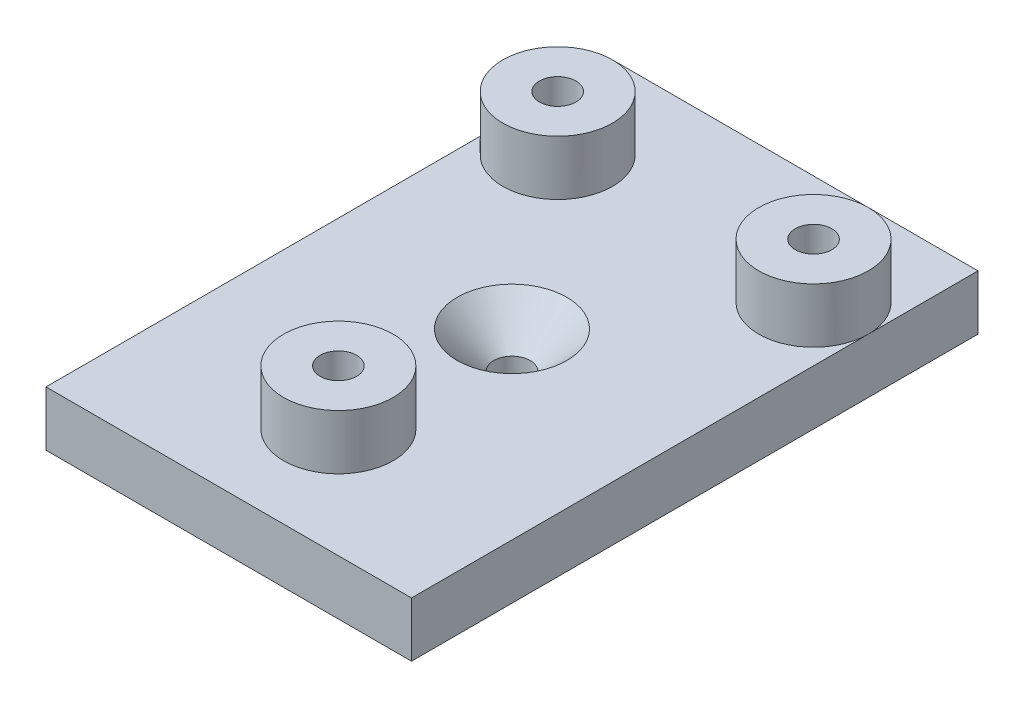
ISO-10303-21;
HEADER;
FILE_DESCRIPTION(('STEP AP214'),'2;1');
FILE_NAME('part.step','',(''),(''),'','','');
FILE_SCHEMA(('AUTOMOTIVE_DESIGN { 1 0 10303 214 1 1 1 1 }'));
ENDSEC;
DATA;
#1=APPLICATION_CONTEXT('core data for automotive mechanical design processes');
#2=APPLICATION_PROTOCOL_DEFINITION('international standard','automotive_design',2000,#1);
#3=PRODUCT_CONTEXT('',#1,'mechanical');
#4=PRODUCT('Part','Part','',(#3));
#5=PRODUCT_RELATED_PRODUCT_CATEGORY('part','',(#4));
#6=PRODUCT_DEFINITION_FORMATION('','',#4);
#7=PRODUCT_DEFINITION_CONTEXT('part definition',#1,'design');
#8=PRODUCT_DEFINITION('design','',#6,#7);
#9=PRODUCT_DEFINITION_SHAPE('','',#8);
#10=(LENGTH_UNIT() NAMED_UNIT(*) SI_UNIT(.MILLI.,.METRE.));
#11=(NAMED_UNIT(*) PLANE_ANGLE_UNIT() SI_UNIT($,.RADIAN.));
#12=(NAMED_UNIT(*) SI_UNIT($,.STERADIAN.) SOLID_ANGLE_UNIT());
#13=UNCERTAINTY_MEASURE_WITH_UNIT(LENGTH_MEASURE(1.E-05),#10,'distance_accuracy_value','');
#14=(GEOMETRIC_REPRESENTATION_CONTEXT(3) GLOBAL_UNCERTAINTY_ASSIGNED_CONTEXT((#13)) GLOBAL_UNIT_ASSIGNED_CONTEXT((#10,
#11,#12)) REPRESENTATION_CONTEXT('',''));
#15=CARTESIAN_POINT('',(0.,0.,0.));
#16=DIRECTION('',(0.,0.,1.));
#17=DIRECTION('',(1.,0.,0.));
#18=AXIS2_PLACEMENT_3D('',#15,#16,#17);
#19=CARTESIAN_POINT('',(-10.9436046511628,3.,-6.58255813953488));
#20=DIRECTION('',(1.,0.,0.));
#21=DIRECTION('',(0.,0.,-1.));
#22=AXIS2_PLACEMENT_3D('',#19,#20,#21);
#23=PLANE('',#22);
#24=DIRECTION('',(0.,0.,1.));
#25=VECTOR('',#24,1.);
#26=CARTESIAN_POINT('',(-10.9436046511628,0.,-6.58255813953488));
#27=LINE('',#26,#25);
#28=CARTESIAN_POINT('',(-10.9436046511628,0.,-6.58255813953488));
#29=VERTEX_POINT('',#28);
#30=CARTESIAN_POINT('',(-10.9436046511628,0.,24.4174418604651));
#31=VERTEX_POINT('',#30);
#32=EDGE_CURVE('E122',#29,#31,#27,.T.);
#33=ORIENTED_EDGE('',*,*,#32,.T.);
#34=DIRECTION('',(0.,-1.,0.));
#35=VECTOR('',#34,1.);
#36=CARTESIAN_POINT('',(-10.9436046511628,3.,24.4174418604651));
#37=LINE('',#36,#35);
#38=CARTESIAN_POINT('',(-10.9436046511628,3.,24.4174418604651));
#39=VERTEX_POINT('',#38);
#40=EDGE_CURVE('E110',#39,#31,#37,.T.);
#41=ORIENTED_EDGE('',*,*,#40,.F.);
#42=DIRECTION('',(0.,0.,1.));
#43=VECTOR('',#42,1.);
#44=CARTESIAN_POINT('',(-10.9436046511628,3.,-6.58255813953488));
#45=LINE('',#44,#43);
#46=CARTESIAN_POINT('',(-10.9436046511628,3.,-0.582558139534882));
#47=VERTEX_POINT('',#46);
#48=EDGE_CURVE('E95',#47,#39,#45,.T.);
#49=ORIENTED_EDGE('',*,*,#48,.F.);
#50=CARTESIAN_POINT('',(-10.9436046511628,3.,-6.58255813953488));
#51=VERTEX_POINT('',#50);
#52=EDGE_CURVE('E99',#51,#47,#45,.T.);
#53=ORIENTED_EDGE('',*,*,#52,.F.);
#54=DIRECTION('',(0.,-1.,0.));
#55=VECTOR('',#54,1.);
#56=CARTESIAN_POINT('',(-10.9436046511628,3.,-6.58255813953488));
#57=LINE('',#56,#55);
#58=EDGE_CURVE('E121',#51,#29,#57,.T.);
#59=ORIENTED_EDGE('',*,*,#58,.T.);
#60=EDGE_LOOP('',(#33,#41,#49,#53,#59));
#61=FACE_BOUND('',#60,.T.);
#62=ADVANCED_FACE('F45',(#61),#23,.F.);
#63=CARTESIAN_POINT('',(-10.9436046511628,3.,24.4174418604651));
#64=DIRECTION('',(0.,0.,-1.));
#65=DIRECTION('',(-1.,0.,0.));
#66=AXIS2_PLACEMENT_3D('',#63,#64,#65);
#67=PLANE('',#66);
#68=DIRECTION('',(1.,0.,0.));
#69=VECTOR('',#68,1.);
#70=CARTESIAN_POINT('',(-10.9436046511628,0.,24.4174418604651));
#71=LINE('',#70,#69);
#72=CARTESIAN_POINT('',(9.05639534883721,0.,24.4174418604651));
#73=VERTEX_POINT('',#72);
#74=EDGE_CURVE('E124',#31,#73,#71,.T.);
#75=ORIENTED_EDGE('',*,*,#74,.T.);
#76=DIRECTION('',(0.,-1.,0.));
#77=VECTOR('',#76,1.);
#78=CARTESIAN_POINT('',(9.05639534883721,3.,24.4174418604651));
#79=LINE('',#78,#77);
#80=CARTESIAN_POINT('',(9.05639534883721,3.,24.4174418604651));
#81=VERTEX_POINT('',#80);
#82=EDGE_CURVE('E131',#81,#73,#79,.T.);
#83=ORIENTED_EDGE('',*,*,#82,.F.);
#84=DIRECTION('',(1.,0.,0.));
#85=VECTOR('',#84,1.);
#86=CARTESIAN_POINT('',(-10.9436046511628,3.,24.4174418604651));
#87=LINE('',#86,#85);
#88=EDGE_CURVE('E105',#39,#81,#87,.T.);
#89=ORIENTED_EDGE('',*,*,#88,.F.);
#90=ORIENTED_EDGE('',*,*,#40,.T.);
#91=EDGE_LOOP('',(#75,#83,#89,#90));
#92=FACE_BOUND('',#91,.T.);
#93=ADVANCED_FACE('F155',(#92),#67,.F.);
#94=CARTESIAN_POINT('',(9.05639534883721,3.,-6.58255813953488));
#95=DIRECTION('',(-1.,0.,0.));
#96=DIRECTION('',(0.,0.,1.));
#97=AXIS2_PLACEMENT_3D('',#94,#95,#96);
#98=PLANE('',#97);
#99=DIRECTION('',(0.,0.,-1.));
#100=VECTOR('',#99,1.);
#101=CARTESIAN_POINT('',(9.05639534883721,0.,-6.58255813953488));
#102=LINE('',#101,#100);
#103=CARTESIAN_POINT('',(9.05639534883721,0.,-6.58255813953488));
#104=VERTEX_POINT('',#103);
#105=EDGE_CURVE('E111',#73,#104,#102,.T.);
#106=ORIENTED_EDGE('',*,*,#105,.T.);
#107=DIRECTION('',(0.,-1.,0.));
#108=VECTOR('',#107,1.);
#109=CARTESIAN_POINT('',(9.05639534883721,3.,-6.58255813953488));
#110=LINE('',#109,#108);
#111=CARTESIAN_POINT('',(9.05639534883721,3.,-6.58255813953488));
#112=VERTEX_POINT('',#111);
#113=EDGE_CURVE('E129',#112,#104,#110,.T.);
#114=ORIENTED_EDGE('',*,*,#113,.F.);
#115=DIRECTION('',(0.,0.,-1.));
#116=VECTOR('',#115,1.);
#117=CARTESIAN_POINT('',(9.05639534883721,3.,-6.58255813953488));
#118=LINE('',#117,#116);
#119=CARTESIAN_POINT('',(9.05639534883721,3.,-0.582558139534882));
#120=VERTEX_POINT('',#119);
#121=EDGE_CURVE('E117',#120,#112,#118,.T.);
#122=ORIENTED_EDGE('',*,*,#121,.F.);
#123=EDGE_CURVE('E118',#81,#120,#118,.T.);
#124=ORIENTED_EDGE('',*,*,#123,.F.);
#125=ORIENTED_EDGE('',*,*,#82,.T.);
#126=EDGE_LOOP('',(#106,#114,#122,#124,#125));
#127=FACE_BOUND('',#126,.T.);
#128=ADVANCED_FACE('F161',(#127),#98,.F.);
#129=CARTESIAN_POINT('',(-10.9436046511628,3.,-6.58255813953488));
#130=DIRECTION('',(0.,0.,1.));
#131=DIRECTION('',(1.,0.,0.));
#132=AXIS2_PLACEMENT_3D('',#129,#130,#131);
#133=PLANE('',#132);
#134=DIRECTION('',(-1.,0.,0.));
#135=VECTOR('',#134,1.);
#136=CARTESIAN_POINT('',(-10.9436046511628,0.,-6.58255813953488));
#137=LINE('',#136,#135);
#138=EDGE_CURVE('E88',#104,#29,#137,.T.);
#139=ORIENTED_EDGE('',*,*,#138,.T.);
#140=ORIENTED_EDGE('',*,*,#58,.F.);
#141=DIRECTION('',(-1.,0.,0.));
#142=VECTOR('',#141,1.);
#143=CARTESIAN_POINT('',(-10.9436046511628,3.,-6.58255813953488));
#144=LINE('',#143,#142);
#145=EDGE_CURVE('E67',#112,#51,#144,.T.);
#146=ORIENTED_EDGE('',*,*,#145,.F.);
#147=ORIENTED_EDGE('',*,*,#113,.T.);
#148=EDGE_LOOP('',(#139,#140,#146,#147));
#149=FACE_BOUND('',#148,.T.);
#150=ADVANCED_FACE('F166',(#149),#133,.F.);
#151=CARTESIAN_POINT('',(0.,3.,0.));
#152=DIRECTION('',(0.,1.,0.));
#153=DIRECTION('',(0.,0.,1.));
#154=AXIS2_PLACEMENT_3D('',#151,#152,#153);
#155=PLANE('',#154);
#156=CARTESIAN_POINT('',(-0.943604651162789,3.,8.91744186046512));
#157=DIRECTION('',(0.,1.,0.));
#158=DIRECTION('',(0.,0.,1.));
#159=AXIS2_PLACEMENT_3D('',#156,#157,#158);
#160=CIRCLE('',#159,3.00000000000001);
#161=CARTESIAN_POINT('',(-0.943604651162789,3.,11.9174418604651));
#162=VERTEX_POINT('',#161);
#163=EDGE_CURVE('E11',#162,#162,#160,.F.);
#164=ORIENTED_EDGE('',*,*,#163,.T.);
#165=EDGE_LOOP('',(#164));
#166=FACE_BOUND('',#165,.T.);
#167=CARTESIAN_POINT('',(-0.943604651162788,3.,18.4174418604651));
#168=DIRECTION('',(0.,1.,0.));
#169=DIRECTION('',(0.,0.,1.));
#170=AXIS2_PLACEMENT_3D('',#167,#168,#169);
#171=CIRCLE('',#170,3.);
#172=CARTESIAN_POINT('',(-0.943604651162788,3.,21.4174418604651));
#173=VERTEX_POINT('',#172);
#174=EDGE_CURVE('E221',#173,#173,#171,.T.);
#175=ORIENTED_EDGE('',*,*,#174,.F.);
#176=EDGE_LOOP('',(#175));
#177=FACE_BOUND('',#176,.T.);
#178=ORIENTED_EDGE('',*,*,#123,.T.);
#179=CARTESIAN_POINT('',(6.05639534883721,3.,-0.582558139534882));
#180=DIRECTION('',(0.,1.,0.));
#181=DIRECTION('',(0.,0.,-1.));
#182=AXIS2_PLACEMENT_3D('',#179,#180,#181);
#183=CIRCLE('',#182,3.);
#184=EDGE_CURVE('E59',#120,#120,#183,.T.);
#185=ORIENTED_EDGE('',*,*,#184,.F.);
#186=ORIENTED_EDGE('',*,*,#121,.T.);
#187=ORIENTED_EDGE('',*,*,#145,.T.);
#188=ORIENTED_EDGE('',*,*,#52,.T.);
#189=CARTESIAN_POINT('',(-7.94360465116279,3.,-0.582558139534882));
#190=DIRECTION('',(0.,1.,0.));
#191=DIRECTION('',(0.,0.,1.));
#192=AXIS2_PLACEMENT_3D('',#189,#190,#191);
#193=CIRCLE('',#192,3.);
#194=EDGE_CURVE('E103',#47,#47,#193,.T.);
#195=ORIENTED_EDGE('',*,*,#194,.F.);
#196=ORIENTED_EDGE('',*,*,#48,.T.);
#197=ORIENTED_EDGE('',*,*,#88,.T.);
#198=EDGE_LOOP('',(#178,#185,#186,#187,#188,#195,#196,#197));
#199=FACE_BOUND('',#198,.T.);
#200=ADVANCED_FACE('F101',(#166,#177,#199),#155,.T.);
#201=CARTESIAN_POINT('',(0.,0.,0.));
#202=DIRECTION('',(0.,1.,0.));
#203=DIRECTION('',(0.,0.,1.));
#204=AXIS2_PLACEMENT_3D('',#201,#202,#203);
#205=PLANE('',#204);
#206=CARTESIAN_POINT('',(-0.943604651162789,0.,8.91744186046512));
#207=DIRECTION('',(0.,1.,0.));
#208=DIRECTION('',(0.,0.,1.));
#209=AXIS2_PLACEMENT_3D('',#206,#207,#208);
#210=CIRCLE('',#209,1.);
#211=CARTESIAN_POINT('',(-0.943604651162789,0.,9.91744186046512));
#212=VERTEX_POINT('',#211);
#213=EDGE_CURVE('E228',#212,#212,#210,.T.);
#214=ORIENTED_EDGE('',*,*,#213,.T.);
#215=EDGE_LOOP('',(#214));
#216=FACE_BOUND('',#215,.T.);
#217=ORIENTED_EDGE('',*,*,#32,.F.);
#218=ORIENTED_EDGE('',*,*,#138,.F.);
#219=ORIENTED_EDGE('',*,*,#105,.F.);
#220=ORIENTED_EDGE('',*,*,#74,.F.);
#221=EDGE_LOOP('',(#217,#218,#219,#220));
#222=FACE_BOUND('',#221,.T.);
#223=ADVANCED_FACE('F169',(#216,#222),#205,.F.);
#224=CARTESIAN_POINT('',(-7.94360465116279,6.,-0.582558139534882));
#225=DIRECTION('',(0.,1.,0.));
#226=DIRECTION('',(0.,0.,1.));
#227=AXIS2_PLACEMENT_3D('',#224,#225,#226);
#228=PLANE('',#227);
#229=CARTESIAN_POINT('',(-7.94360465116279,6.,-0.582558139534882));
#230=DIRECTION('',(0.,1.,0.));
#231=DIRECTION('',(0.,0.,1.));
#232=AXIS2_PLACEMENT_3D('',#229,#230,#231);
#233=CIRCLE('',#232,3.);
#234=CARTESIAN_POINT('',(-7.94360465116279,6.,2.41744186046512));
#235=VERTEX_POINT('',#234);
#236=EDGE_CURVE('E125',#235,#235,#233,.T.);
#237=ORIENTED_EDGE('',*,*,#236,.T.);
#238=EDGE_LOOP('',(#237));
#239=FACE_BOUND('',#238,.T.);
#240=CARTESIAN_POINT('',(-7.94360465116279,6.,-0.582558139534882));
#241=DIRECTION('',(0.,1.,0.));
#242=DIRECTION('',(0.,0.,1.));
#243=AXIS2_PLACEMENT_3D('',#240,#241,#242);
#244=CIRCLE('',#243,1.);
#245=CARTESIAN_POINT('',(-7.94360465116279,6.,0.417441860465118));
#246=VERTEX_POINT('',#245);
#247=EDGE_CURVE('E239',#246,#246,#244,.T.);
#248=ORIENTED_EDGE('',*,*,#247,.F.);
#249=EDGE_LOOP('',(#248));
#250=FACE_BOUND('',#249,.T.);
#251=ADVANCED_FACE('F172',(#239,#250),#228,.T.);
#252=CARTESIAN_POINT('',(-7.94360465116279,6.,-0.582558139534882));
#253=DIRECTION('',(0.,-1.,0.));
#254=DIRECTION('',(0.,0.,-1.));
#255=AXIS2_PLACEMENT_3D('',#252,#253,#254);
#256=CYLINDRICAL_SURFACE('',#255,3.);
#257=ORIENTED_EDGE('',*,*,#236,.F.);
#258=EDGE_LOOP('',(#257));
#259=FACE_BOUND('',#258,.T.);
#260=ORIENTED_EDGE('',*,*,#194,.T.);
#261=EDGE_LOOP('',(#260));
#262=FACE_BOUND('',#261,.T.);
#263=ADVANCED_FACE('F178',(#259,#262),#256,.T.);
#264=CARTESIAN_POINT('',(-7.94360465116279,6.,-0.582558139534882));
#265=DIRECTION('',(0.,-1.,0.));
#266=DIRECTION('',(0.,0.,-1.));
#267=AXIS2_PLACEMENT_3D('',#264,#265,#266);
#268=CYLINDRICAL_SURFACE('',#267,1.);
#269=ORIENTED_EDGE('',*,*,#247,.T.);
#270=EDGE_LOOP('',(#269));
#271=FACE_BOUND('',#270,.T.);
#272=CARTESIAN_POINT('',(-7.94360465116279,3.,-0.582558139534882));
#273=DIRECTION('',(0.,1.,0.));
#274=DIRECTION('',(0.,0.,1.));
#275=AXIS2_PLACEMENT_3D('',#272,#273,#274);
#276=CIRCLE('',#275,1.);
#277=CARTESIAN_POINT('',(-7.94360465116279,3.,0.417441860465118));
#278=VERTEX_POINT('',#277);
#279=EDGE_CURVE('E238',#278,#278,#276,.T.);
#280=ORIENTED_EDGE('',*,*,#279,.F.);
#281=EDGE_LOOP('',(#280));
#282=FACE_BOUND('',#281,.T.);
#283=ADVANCED_FACE('F181',(#271,#282),#268,.F.);
#284=ORIENTED_EDGE('',*,*,#279,.T.);
#285=EDGE_LOOP('',(#284));
#286=FACE_BOUND('',#285,.T.);
#287=ADVANCED_FACE('F177',(#286),#155,.T.);
#288=CARTESIAN_POINT('',(6.05639534883721,6.,-0.582558139534882));
#289=DIRECTION('',(0.,-1.,0.));
#290=DIRECTION('',(0.,0.,-1.));
#291=AXIS2_PLACEMENT_3D('',#288,#289,#290);
#292=PLANE('',#291);
#293=CARTESIAN_POINT('',(6.05639534883721,6.,-0.582558139534882));
#294=DIRECTION('',(0.,1.,0.));
#295=DIRECTION('',(0.,0.,-1.));
#296=AXIS2_PLACEMENT_3D('',#293,#294,#295);
#297=CIRCLE('',#296,3.);
#298=CARTESIAN_POINT('',(6.05639534883721,6.,-3.58255813953488));
#299=VERTEX_POINT('',#298);
#300=EDGE_CURVE('E226',#299,#299,#297,.T.);
#301=ORIENTED_EDGE('',*,*,#300,.T.);
#302=EDGE_LOOP('',(#301));
#303=FACE_BOUND('',#302,.T.);
#304=CARTESIAN_POINT('',(6.05639534883721,6.,-0.582558139534882));
#305=DIRECTION('',(0.,1.,0.));
#306=DIRECTION('',(0.,0.,-1.));
#307=AXIS2_PLACEMENT_3D('',#304,#305,#306);
#308=CIRCLE('',#307,1.);
#309=CARTESIAN_POINT('',(6.05639534883721,6.,-1.58255813953488));
#310=VERTEX_POINT('',#309);
#311=EDGE_CURVE('E233',#310,#310,#308,.T.);
#312=ORIENTED_EDGE('',*,*,#311,.F.);
#313=EDGE_LOOP('',(#312));
#314=FACE_BOUND('',#313,.T.);
#315=ADVANCED_FACE('F195',(#303,#314),#292,.F.);
#316=CARTESIAN_POINT('',(6.05639534883721,6.,-0.582558139534882));
#317=DIRECTION('',(0.,-1.,0.));
#318=DIRECTION('',(0.,0.,-1.));
#319=AXIS2_PLACEMENT_3D('',#316,#317,#318);
#320=CYLINDRICAL_SURFACE('',#319,3.);
#321=ORIENTED_EDGE('',*,*,#300,.F.);
#322=EDGE_LOOP('',(#321));
#323=FACE_BOUND('',#322,.T.);
#324=ORIENTED_EDGE('',*,*,#184,.T.);
#325=EDGE_LOOP('',(#324));
#326=FACE_BOUND('',#325,.T.);
#327=ADVANCED_FACE('F193',(#323,#326),#320,.T.);
#328=CARTESIAN_POINT('',(6.05639534883721,6.,-0.582558139534882));
#329=DIRECTION('',(0.,-1.,0.));
#330=DIRECTION('',(0.,0.,-1.));
#331=AXIS2_PLACEMENT_3D('',#328,#329,#330);
#332=CYLINDRICAL_SURFACE('',#331,1.);
#333=ORIENTED_EDGE('',*,*,#311,.T.);
#334=EDGE_LOOP('',(#333));
#335=FACE_BOUND('',#334,.T.);
#336=CARTESIAN_POINT('',(6.05639534883721,3.,-0.582558139534882));
#337=DIRECTION('',(0.,1.,0.));
#338=DIRECTION('',(0.,0.,1.));
#339=AXIS2_PLACEMENT_3D('',#336,#337,#338);
#340=CIRCLE('',#339,1.);
#341=CARTESIAN_POINT('',(6.05639534883721,3.,0.417441860465118));
#342=VERTEX_POINT('',#341);
#343=EDGE_CURVE('E135',#342,#342,#340,.F.);
#344=ORIENTED_EDGE('',*,*,#343,.T.);
#345=EDGE_LOOP('',(#344));
#346=FACE_BOUND('',#345,.T.);
#347=ADVANCED_FACE('F189',(#335,#346),#332,.F.);
#348=ORIENTED_EDGE('',*,*,#343,.F.);
#349=EDGE_LOOP('',(#348));
#350=FACE_BOUND('',#349,.T.);
#351=ADVANCED_FACE('F192',(#350),#155,.T.);
#352=CARTESIAN_POINT('',(-0.943604651162788,6.,18.4174418604651));
#353=DIRECTION('',(0.,1.,0.));
#354=DIRECTION('',(0.,0.,1.));
#355=AXIS2_PLACEMENT_3D('',#352,#353,#354);
#356=PLANE('',#355);
#357=CARTESIAN_POINT('',(-0.943604651162788,6.,18.4174418604651));
#358=DIRECTION('',(0.,1.,0.));
#359=DIRECTION('',(0.,0.,1.));
#360=AXIS2_PLACEMENT_3D('',#357,#358,#359);
#361=CIRCLE('',#360,3.);
#362=CARTESIAN_POINT('',(-0.943604651162788,6.,21.4174418604651));
#363=VERTEX_POINT('',#362);
#364=EDGE_CURVE('E218',#363,#363,#361,.T.);
#365=ORIENTED_EDGE('',*,*,#364,.T.);
#366=EDGE_LOOP('',(#365));
#367=FACE_BOUND('',#366,.T.);
#368=CARTESIAN_POINT('',(-0.943604651162788,6.,18.4174418604651));
#369=DIRECTION('',(0.,1.,0.));
#370=DIRECTION('',(0.,0.,1.));
#371=AXIS2_PLACEMENT_3D('',#368,#369,#370);
#372=CIRCLE('',#371,0.999999999999999);
#373=CARTESIAN_POINT('',(-0.943604651162788,6.,19.4174418604651));
#374=VERTEX_POINT('',#373);
#375=EDGE_CURVE('E223',#374,#374,#372,.T.);
#376=ORIENTED_EDGE('',*,*,#375,.F.);
#377=EDGE_LOOP('',(#376));
#378=FACE_BOUND('',#377,.T.);
#379=ADVANCED_FACE('F207',(#367,#378),#356,.T.);
#380=CARTESIAN_POINT('',(-0.943604651162788,6.,18.4174418604651));
#381=DIRECTION('',(0.,-1.,0.));
#382=DIRECTION('',(0.,0.,-1.));
#383=AXIS2_PLACEMENT_3D('',#380,#381,#382);
#384=CYLINDRICAL_SURFACE('',#383,3.);
#385=ORIENTED_EDGE('',*,*,#364,.F.);
#386=EDGE_LOOP('',(#385));
#387=FACE_BOUND('',#386,.T.);
#388=ORIENTED_EDGE('',*,*,#174,.T.);
#389=EDGE_LOOP('',(#388));
#390=FACE_BOUND('',#389,.T.);
#391=ADVANCED_FACE('F205',(#387,#390),#384,.T.);
#392=CARTESIAN_POINT('',(-0.943604651162788,6.,18.4174418604651));
#393=DIRECTION('',(0.,-1.,0.));
#394=DIRECTION('',(0.,0.,-1.));
#395=AXIS2_PLACEMENT_3D('',#392,#393,#394);
#396=CYLINDRICAL_SURFACE('',#395,0.999999999999999);
#397=ORIENTED_EDGE('',*,*,#375,.T.);
#398=EDGE_LOOP('',(#397));
#399=FACE_BOUND('',#398,.T.);
#400=CARTESIAN_POINT('',(-0.943604651162788,3.,18.4174418604651));
#401=DIRECTION('',(0.,1.,0.));
#402=DIRECTION('',(0.,0.,1.));
#403=AXIS2_PLACEMENT_3D('',#400,#401,#402);
#404=CIRCLE('',#403,0.999999999999999);
#405=CARTESIAN_POINT('',(-0.943604651162788,3.,19.4174418604651));
#406=VERTEX_POINT('',#405);
#407=EDGE_CURVE('E138',#406,#406,#404,.F.);
#408=ORIENTED_EDGE('',*,*,#407,.T.);
#409=EDGE_LOOP('',(#408));
#410=FACE_BOUND('',#409,.T.);
#411=ADVANCED_FACE('F202',(#399,#410),#396,.F.);
#412=ORIENTED_EDGE('',*,*,#407,.F.);
#413=EDGE_LOOP('',(#412));
#414=FACE_BOUND('',#413,.T.);
#415=ADVANCED_FACE('F151',(#414),#155,.T.);
#416=CARTESIAN_POINT('',(-0.943604651162789,0.,8.91744186046512));
#417=DIRECTION('',(0.,1.,0.));
#418=DIRECTION('',(0.,0.,1.));
#419=AXIS2_PLACEMENT_3D('',#416,#417,#418);
#420=CYLINDRICAL_SURFACE('',#419,1.);
#421=CARTESIAN_POINT('',(-0.943604651162789,1.,8.91744186046512));
#422=DIRECTION('',(0.,1.,0.));
#423=DIRECTION('',(0.,0.,1.));
#424=AXIS2_PLACEMENT_3D('',#421,#422,#423);
#425=CIRCLE('',#424,1.);
#426=CARTESIAN_POINT('',(-0.943604651162789,1.,9.91744186046512));
#427=VERTEX_POINT('',#426);
#428=EDGE_CURVE('E54',#427,#427,#425,.T.);
#429=ORIENTED_EDGE('',*,*,#428,.T.);
#430=EDGE_LOOP('',(#429));
#431=FACE_BOUND('',#430,.T.);
#432=ORIENTED_EDGE('',*,*,#213,.F.);
#433=EDGE_LOOP('',(#432));
#434=FACE_BOUND('',#433,.T.);
#435=ADVANCED_FACE('F143',(#431,#434),#420,.F.);
#436=CARTESIAN_POINT('',(-0.943604651162789,1.,8.91744186046512));
#437=DIRECTION('',(0.,1.,0.));
#438=DIRECTION('',(0.,0.,1.));
#439=AXIS2_PLACEMENT_3D('',#436,#437,#438);
#440=CONICAL_SURFACE('',#439,1.,0.785398163397451);
#441=ORIENTED_EDGE('',*,*,#163,.F.);
#442=EDGE_LOOP('',(#441));
#443=FACE_BOUND('',#442,.T.);
#444=ORIENTED_EDGE('',*,*,#428,.F.);
#445=EDGE_LOOP('',(#444));
#446=FACE_BOUND('',#445,.T.);
#447=ADVANCED_FACE('F48',(#443,#446),#440,.F.);
#448=CLOSED_SHELL('',(#62,#93,#128,#150,#200,#223,#251,#263,#283,#287,#315,#327,#347,#351,#379,
#391,#411,#415,#435,#447));
#449=MANIFOLD_SOLID_BREP('B2',#448);
#450=ADVANCED_BREP_SHAPE_REPRESENTATION('',(#18,#449),#14);
#451=SHAPE_DEFINITION_REPRESENTATION(#9,#450);
ENDSEC;
END-ISO-10303-21;
